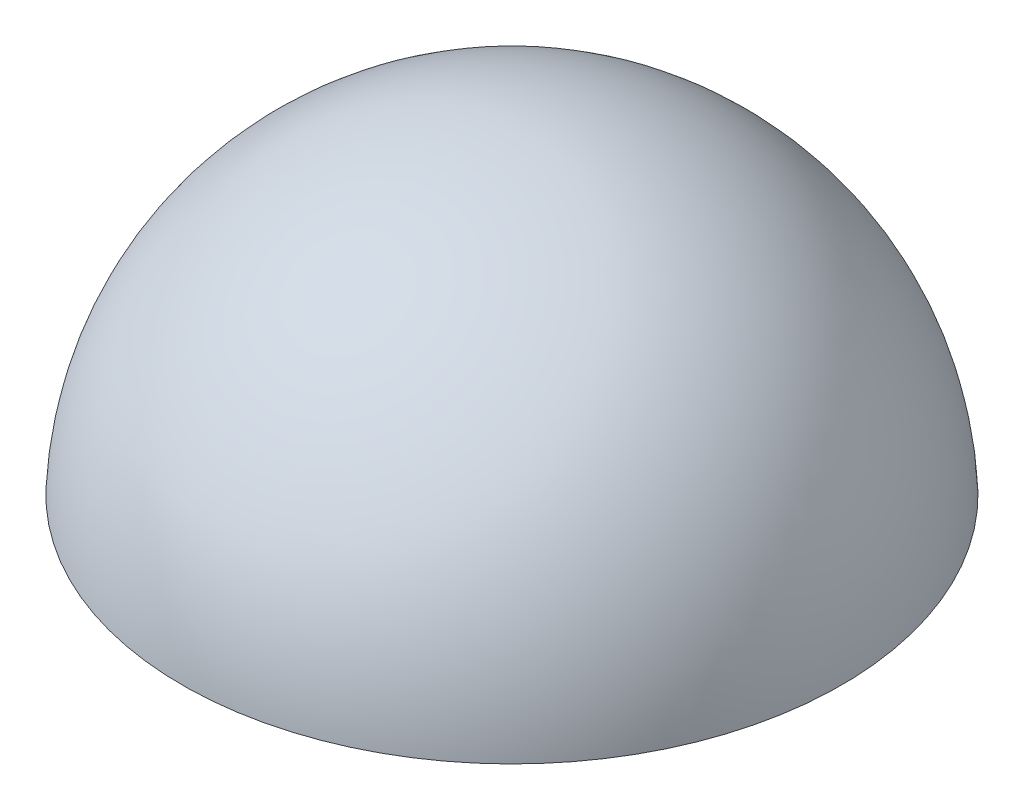
ISO-10303-21;
HEADER;
FILE_DESCRIPTION(('STEP AP214'),'2;1');
FILE_NAME('part.step','',(''),(''),'','','');
FILE_SCHEMA(('AUTOMOTIVE_DESIGN { 1 0 10303 214 1 1 1 1 }'));
ENDSEC;
DATA;
#1=APPLICATION_CONTEXT('core data for automotive mechanical design processes');
#2=APPLICATION_PROTOCOL_DEFINITION('international standard','automotive_design',2000,#1);
#3=PRODUCT_CONTEXT('',#1,'mechanical');
#4=PRODUCT('Part','Part','',(#3));
#5=PRODUCT_RELATED_PRODUCT_CATEGORY('part','',(#4));
#6=PRODUCT_DEFINITION_FORMATION('','',#4);
#7=PRODUCT_DEFINITION_CONTEXT('part definition',#1,'design');
#8=PRODUCT_DEFINITION('design','',#6,#7);
#9=PRODUCT_DEFINITION_SHAPE('','',#8);
#10=(LENGTH_UNIT() NAMED_UNIT(*) SI_UNIT(.MILLI.,.METRE.));
#11=(NAMED_UNIT(*) PLANE_ANGLE_UNIT() SI_UNIT($,.RADIAN.));
#12=(NAMED_UNIT(*) SI_UNIT($,.STERADIAN.) SOLID_ANGLE_UNIT());
#13=UNCERTAINTY_MEASURE_WITH_UNIT(LENGTH_MEASURE(1.E-05),#10,'distance_accuracy_value','');
#14=(GEOMETRIC_REPRESENTATION_CONTEXT(3) GLOBAL_UNCERTAINTY_ASSIGNED_CONTEXT((#13)) GLOBAL_UNIT_ASSIGNED_CONTEXT((#10,
#11,#12)) REPRESENTATION_CONTEXT('',''));
#15=CARTESIAN_POINT('',(0.,0.,0.));
#16=DIRECTION('',(0.,0.,1.));
#17=DIRECTION('',(1.,0.,0.));
#18=AXIS2_PLACEMENT_3D('',#15,#16,#17);
#19=CARTESIAN_POINT('',(0.,0.,0.));
#20=DIRECTION('',(-1.,0.,0.));
#21=DIRECTION('',(0.,0.,1.));
#22=AXIS2_PLACEMENT_3D('',#19,#20,#21);
#23=SPHERICAL_SURFACE('',#22,44.45);
#24=CARTESIAN_POINT('',(0.,0.,0.));
#25=DIRECTION('',(0.,1.,0.));
#26=DIRECTION('',(-1.,0.,0.));
#27=AXIS2_PLACEMENT_3D('',#24,#25,#26);
#28=SPHERICAL_SURFACE('',#27,44.45);
#29=CARTESIAN_POINT('',(0.,2.04999999999999,0.));
#30=DIRECTION('',(0.,1.,0.));
#31=DIRECTION('',(-1.,0.,0.));
#32=AXIS2_PLACEMENT_3D('',#29,#30,#31);
#33=CIRCLE('',#32,44.4027026204487);
#34=CARTESIAN_POINT('',(-44.4027026204487,2.04999999999999,0.));
#35=VERTEX_POINT('',#34);
#36=EDGE_CURVE('E42',#35,#35,#33,.T.);
#37=ORIENTED_EDGE('',*,*,#36,.T.);
#38=EDGE_LOOP('',(#37));
#39=FACE_BOUND('',#38,.T.);
#40=ADVANCED_FACE('F39',(#39),#28,.T.);
#41=CARTESIAN_POINT('',(59.1279965598101,2.05,-44.45));
#42=DIRECTION('',(0.,1.,0.));
#43=DIRECTION('',(-1.,0.,0.));
#44=AXIS2_PLACEMENT_3D('',#41,#42,#43);
#45=PLANE('',#44);
#46=CARTESIAN_POINT('',(0.,2.04999999999999,0.));
#47=DIRECTION('',(0.,1.,0.));
#48=DIRECTION('',(-1.,0.,0.));
#49=AXIS2_PLACEMENT_3D('',#46,#47,#48);
#50=CIRCLE('',#49,42.4004716954894);
#51=CARTESIAN_POINT('',(-42.4004716954894,2.04999999999999,0.));
#52=VERTEX_POINT('',#51);
#53=EDGE_CURVE('E10',#52,#52,#50,.T.);
#54=ORIENTED_EDGE('',*,*,#53,.T.);
#55=EDGE_LOOP('',(#54));
#56=FACE_BOUND('',#55,.T.);
#57=ORIENTED_EDGE('',*,*,#36,.F.);
#58=EDGE_LOOP('',(#57));
#59=FACE_BOUND('',#58,.T.);
#60=ADVANCED_FACE('F54',(#56,#59),#45,.F.);
#61=CARTESIAN_POINT('',(0.,0.,0.));
#62=DIRECTION('',(-1.,0.,0.));
#63=DIRECTION('',(0.,0.,1.));
#64=AXIS2_PLACEMENT_3D('',#61,#62,#63);
#65=SPHERICAL_SURFACE('',#64,42.45);
#66=CARTESIAN_POINT('',(0.,0.,0.));
#67=DIRECTION('',(0.,1.,0.));
#68=DIRECTION('',(-1.,0.,0.));
#69=AXIS2_PLACEMENT_3D('',#66,#67,#68);
#70=SPHERICAL_SURFACE('',#69,42.45);
#71=ORIENTED_EDGE('',*,*,#53,.F.);
#72=EDGE_LOOP('',(#71));
#73=FACE_BOUND('',#72,.T.);
#74=ADVANCED_FACE('F56',(#73),#70,.F.);
#75=CLOSED_SHELL('',(#40,#60,#74));
#76=MANIFOLD_SOLID_BREP('B2',#75);
#77=ADVANCED_BREP_SHAPE_REPRESENTATION('',(#18,#76),#14);
#78=SHAPE_DEFINITION_REPRESENTATION(#9,#77);
ENDSEC;
END-ISO-10303-21;
